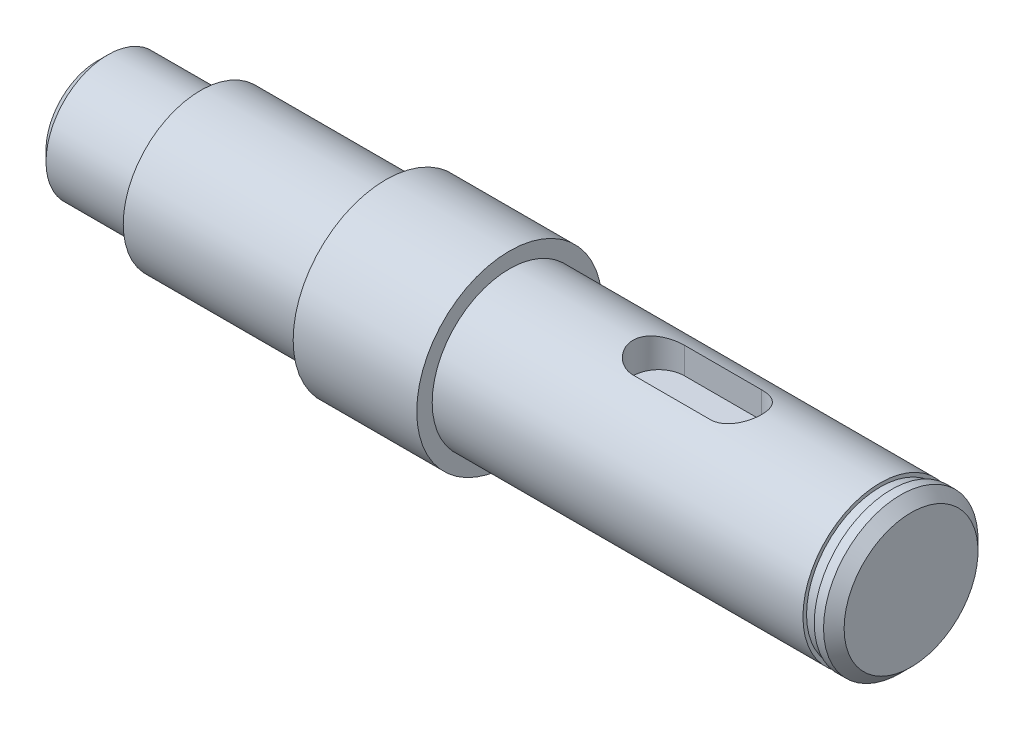
ISO-10303-21;
HEADER;
FILE_DESCRIPTION(('STEP AP214'),'2;1');
FILE_NAME('part.step','',(''),(''),'','','');
FILE_SCHEMA(('AUTOMOTIVE_DESIGN { 1 0 10303 214 1 1 1 1 }'));
ENDSEC;
DATA;
#1=APPLICATION_CONTEXT('core data for automotive mechanical design processes');
#2=APPLICATION_PROTOCOL_DEFINITION('international standard','automotive_design',2000,#1);
#3=PRODUCT_CONTEXT('',#1,'mechanical');
#4=PRODUCT('Part','Part','',(#3));
#5=PRODUCT_RELATED_PRODUCT_CATEGORY('part','',(#4));
#6=PRODUCT_DEFINITION_FORMATION('','',#4);
#7=PRODUCT_DEFINITION_CONTEXT('part definition',#1,'design');
#8=PRODUCT_DEFINITION('design','',#6,#7);
#9=PRODUCT_DEFINITION_SHAPE('','',#8);
#10=(LENGTH_UNIT() NAMED_UNIT(*) SI_UNIT(.MILLI.,.METRE.));
#11=(NAMED_UNIT(*) PLANE_ANGLE_UNIT() SI_UNIT($,.RADIAN.));
#12=(NAMED_UNIT(*) SI_UNIT($,.STERADIAN.) SOLID_ANGLE_UNIT());
#13=UNCERTAINTY_MEASURE_WITH_UNIT(LENGTH_MEASURE(1.E-05),#10,'distance_accuracy_value','');
#14=(GEOMETRIC_REPRESENTATION_CONTEXT(3) GLOBAL_UNCERTAINTY_ASSIGNED_CONTEXT((#13)) GLOBAL_UNIT_ASSIGNED_CONTEXT((#10,
#11,#12)) REPRESENTATION_CONTEXT('',''));
#15=CARTESIAN_POINT('',(0.,0.,0.));
#16=DIRECTION('',(0.,0.,1.));
#17=DIRECTION('',(1.,0.,0.));
#18=AXIS2_PLACEMENT_3D('',#15,#16,#17);
#19=CARTESIAN_POINT('',(0.,0.,0.));
#20=DIRECTION('',(-1.,0.,0.));
#21=DIRECTION('',(0.,0.,1.));
#22=AXIS2_PLACEMENT_3D('',#19,#20,#21);
#23=CYLINDRICAL_SURFACE('',#22,7.5);
#24=DIRECTION('',(-1.,0.,0.));
#25=VECTOR('',#24,1.);
#26=CARTESIAN_POINT('',(0.,7.07106781186548,-2.5));
#27=LINE('',#26,#25);
#28=CARTESIAN_POINT('',(54.5,7.07106781186548,-2.5));
#29=VERTEX_POINT('',#28);
#30=CARTESIAN_POINT('',(62.,7.07106781186548,-2.5));
#31=VERTEX_POINT('',#30);
#32=EDGE_CURVE('E42',#29,#31,#27,.F.);
#33=ORIENTED_EDGE('',*,*,#32,.T.);
#34=CARTESIAN_POINT('',(62.,7.07106781186548,-2.5));
#35=CARTESIAN_POINT('',(62.0682070778203,7.07105693273157,-2.50000899110406));
#36=CARTESIAN_POINT('',(62.1364080746754,7.07205443904569,-2.49720887221585));
#37=CARTESIAN_POINT('',(62.2722810383493,7.07598524121007,-2.4860604578047));
#38=CARTESIAN_POINT('',(62.3399531429881,7.07891801450643,-2.47771365997202));
#39=CARTESIAN_POINT('',(62.4740904883546,7.08662705252507,-2.45557459422795));
#40=CARTESIAN_POINT('',(62.5405587025509,7.09139784850119,-2.44179847763135));
#41=CARTESIAN_POINT('',(62.6720082685828,7.10262619906002,-2.4089418103012));
#42=CARTESIAN_POINT('',(62.7369895665899,7.10908381460331,-2.38986106786032));
#43=CARTESIAN_POINT('',(62.9289615797146,7.13069940793912,-2.32491551306196));
#44=CARTESIAN_POINT('',(63.05317915747,7.14811243884052,-2.27131416810249));
#45=CARTESIAN_POINT('',(63.2908768114634,7.1869703408752,-2.14517784106254));
#46=CARTESIAN_POINT('',(63.4043502357802,7.20841768551076,-2.07263123268531));
#47=CARTESIAN_POINT('',(63.6217929034708,7.25386182389478,-1.90762995846819));
#48=CARTESIAN_POINT('',(63.7252851427682,7.27792189428067,-1.81456284630833));
#49=CARTESIAN_POINT('',(63.9155171032337,7.32534626726038,-1.61247071190512));
#50=CARTESIAN_POINT('',(64.002253841319,7.34871044533518,-1.50344285413657));
#51=CARTESIAN_POINT('',(64.1586982242624,7.39284706096344,-1.26900922493972));
#52=CARTESIAN_POINT('',(64.2279023077422,7.41353593532888,-1.14325025284462));
#53=CARTESIAN_POINT('',(64.3439807824347,7.44924021883279,-0.881073095475297));
#54=CARTESIAN_POINT('',(64.3908619949257,7.46425736081204,-0.744658181225874));
#55=CARTESIAN_POINT('',(64.4593392762582,7.48647677762783,-0.470073371182888));
#56=CARTESIAN_POINT('',(64.4817581709572,7.49393272446142,-0.332129588153729));
#57=CARTESIAN_POINT('',(64.5032907567385,7.50109021034827,-0.0542474216361892));
#58=CARTESIAN_POINT('',(64.5024100009158,7.50079359709905,0.0856904786402286));
#59=CARTESIAN_POINT('',(64.4778892895995,7.49265096581776,0.357759612692416));
#60=CARTESIAN_POINT('',(64.4551434043953,7.48510152476447,0.489981756428183));
#61=CARTESIAN_POINT('',(64.3890170040208,7.46367401253771,0.748610161077321));
#62=CARTESIAN_POINT('',(64.3456353446747,7.44979559044789,0.875016099077747));
#63=CARTESIAN_POINT('',(64.2389465758055,7.41689170677792,1.12038155754036));
#64=CARTESIAN_POINT('',(64.1753848871424,7.39780094595656,1.23922126412504));
#65=CARTESIAN_POINT('',(64.030350121575,7.35645969200236,1.46481147275368));
#66=CARTESIAN_POINT('',(63.9488721723979,7.33420833994017,1.57155867428944));
#67=CARTESIAN_POINT('',(63.765822374993,7.28765679856813,1.77524334927519));
#68=CARTESIAN_POINT('',(63.6634861409717,7.26330946699775,1.871484029031));
#69=CARTESIAN_POINT('',(63.4438962757135,7.21618726182137,2.04568006205174));
#70=CARTESIAN_POINT('',(63.3266378439929,7.19341289789386,2.12362950795974));
#71=CARTESIAN_POINT('',(63.0782995541157,7.15175078440792,2.26000831398175));
#72=CARTESIAN_POINT('',(62.9470412126673,7.13292537370586,2.31813252376915));
#73=CARTESIAN_POINT('',(62.6758825560254,7.10202742655098,2.41115057675285));
#74=CARTESIAN_POINT('',(62.5359962665697,7.08994423522482,2.4460810901384));
#75=CARTESIAN_POINT('',(62.32895340813,7.07841355236799,2.47914539070207));
#76=CARTESIAN_POINT('',(62.2633965253644,7.07566669236505,2.48696265313779));
#77=CARTESIAN_POINT('',(62.1319048040005,7.07199258928497,2.49738654017799));
#78=CARTESIAN_POINT('',(62.065970563639,7.0710629982382,2.49999988848745));
#79=CARTESIAN_POINT('',(62.,7.07106781186548,2.5));
#80=B_SPLINE_CURVE_WITH_KNOTS('',3,(#34,#35,#36,#37,#38,#39,#40,#41,#42,#43,#44,#45,#46,#47,#48,
#49,#50,#51,#52,#53,#54,#55,#56,#57,#58,#59,#60,#61,#62,#63,#64,#65,#66,#67,#68,#69,#70,#71,#72,
#73,#74,#75,#76,#77,#78,#79),.UNSPECIFIED.,.F.,.F.,(4,2,2,2,2,2,2,2,2,2,2,2,2,2,2,2,2,2,2,2,2,2,
4),(0.,0.20454621183858,0.409037215423656,0.612924429429085,0.816819012805401,1.22401016923257,
1.63145179965526,2.0532786408839,2.47518051341062,2.90809434014447,3.34087579484514,
3.75860278500203,4.17623021758302,4.57747647846034,4.97874498952316,5.38529148746615,
5.79194868153617,6.21771736826823,6.64362337304805,7.07581676501794,7.5073252039879,
7.70536340013571,7.90314555504336),.UNSPECIFIED.);
#81=CARTESIAN_POINT('',(62.,7.07106781186548,2.5));
#82=VERTEX_POINT('',#81);
#83=EDGE_CURVE('E142',#31,#82,#80,.T.);
#84=ORIENTED_EDGE('',*,*,#83,.T.);
#85=DIRECTION('',(-1.,0.,0.));
#86=VECTOR('',#85,1.);
#87=CARTESIAN_POINT('',(0.,7.07106781186548,2.5));
#88=LINE('',#87,#86);
#89=CARTESIAN_POINT('',(54.5,7.07106781186548,2.5));
#90=VERTEX_POINT('',#89);
#91=EDGE_CURVE('E291',#82,#90,#88,.T.);
#92=ORIENTED_EDGE('',*,*,#91,.T.);
#93=CARTESIAN_POINT('',(54.5,7.07106781186548,2.5));
#94=CARTESIAN_POINT('',(54.4317929221797,7.07105693273157,2.50000899110406));
#95=CARTESIAN_POINT('',(54.3635919253246,7.07205443904569,2.49720887221585));
#96=CARTESIAN_POINT('',(54.2277189616507,7.07598524121007,2.4860604578047));
#97=CARTESIAN_POINT('',(54.1600468570119,7.07891801450642,2.47771365997202));
#98=CARTESIAN_POINT('',(54.0259095116455,7.08662705252507,2.45557459422795));
#99=CARTESIAN_POINT('',(53.9594412974491,7.09139784850119,2.44179847763135));
#100=CARTESIAN_POINT('',(53.8279917314172,7.10262619906002,2.4089418103012));
#101=CARTESIAN_POINT('',(53.7630104334101,7.10908381460331,2.38986106786032));
#102=CARTESIAN_POINT('',(53.5710384202854,7.13069940793911,2.32491551306196));
#103=CARTESIAN_POINT('',(53.44682084253,7.14811243884052,2.27131416810249));
#104=CARTESIAN_POINT('',(53.2091231885366,7.1869703408752,2.14517784106254));
#105=CARTESIAN_POINT('',(53.0956497642198,7.20841768551076,2.07263123268532));
#106=CARTESIAN_POINT('',(52.8782070965292,7.25386182389478,1.90762995846819));
#107=CARTESIAN_POINT('',(52.7747148572318,7.27792189428067,1.81456284630833));
#108=CARTESIAN_POINT('',(52.5844828967663,7.32534626726038,1.61247071190512));
#109=CARTESIAN_POINT('',(52.497746158681,7.34871044533518,1.50344285413657));
#110=CARTESIAN_POINT('',(52.3413017757376,7.39284706096344,1.26900922493972));
#111=CARTESIAN_POINT('',(52.2720976922578,7.41353593532888,1.14325025284462));
#112=CARTESIAN_POINT('',(52.1560192175653,7.44924021883279,0.881073095475297));
#113=CARTESIAN_POINT('',(52.1091380050743,7.46425736081204,0.744658181225882));
#114=CARTESIAN_POINT('',(52.0406607237418,7.48647677762783,0.470073371182902));
#115=CARTESIAN_POINT('',(52.0182418290428,7.49393272446142,0.332129588153741));
#116=CARTESIAN_POINT('',(51.9967092432615,7.50109021034827,0.0542474216362003));
#117=CARTESIAN_POINT('',(51.9975899990842,7.50079359709905,-0.0856904786402171));
#118=CARTESIAN_POINT('',(52.0221107104005,7.49265096581776,-0.357759612692405));
#119=CARTESIAN_POINT('',(52.0448565956047,7.48510152476446,-0.489981756428173));
#120=CARTESIAN_POINT('',(52.1109829959792,7.46367401253772,-0.748610161077311));
#121=CARTESIAN_POINT('',(52.1543646553253,7.4497955904479,-0.875016099077736));
#122=CARTESIAN_POINT('',(52.2610534241945,7.41689170677793,-1.12038155754035));
#123=CARTESIAN_POINT('',(52.3246151128576,7.39780094595656,-1.23922126412504));
#124=CARTESIAN_POINT('',(52.469649878425,7.35645969200235,-1.46481147275367));
#125=CARTESIAN_POINT('',(52.5511278276021,7.33420833994017,-1.57155867428943));
#126=CARTESIAN_POINT('',(52.734177625007,7.28765679856813,-1.77524334927518));
#127=CARTESIAN_POINT('',(52.8365138590283,7.26330946699775,-1.871484029031));
#128=CARTESIAN_POINT('',(53.0561037242865,7.21618726182137,-2.04568006205174));
#129=CARTESIAN_POINT('',(53.1733621560071,7.19341289789386,-2.12362950795974));
#130=CARTESIAN_POINT('',(53.4217004458843,7.15175078440792,-2.26000831398174));
#131=CARTESIAN_POINT('',(53.5529587873327,7.13292537370586,-2.31813252376915));
#132=CARTESIAN_POINT('',(53.8241174439746,7.10202742655098,-2.41115057675285));
#133=CARTESIAN_POINT('',(53.9640037334303,7.08994423522482,-2.4460810901384));
#134=CARTESIAN_POINT('',(54.17104659187,7.07841355236799,-2.47914539070207));
#135=CARTESIAN_POINT('',(54.2366034746356,7.07566669236504,-2.48696265313779));
#136=CARTESIAN_POINT('',(54.3680951959995,7.07199258928497,-2.49738654017799));
#137=CARTESIAN_POINT('',(54.434029436361,7.0710629982382,-2.49999988848745));
#138=CARTESIAN_POINT('',(54.5,7.07106781186548,-2.5));
#139=B_SPLINE_CURVE_WITH_KNOTS('',3,(#93,#94,#95,#96,#97,#98,#99,#100,#101,#102,#103,#104,#105,
#106,#107,#108,#109,#110,#111,#112,#113,#114,#115,#116,#117,#118,#119,#120,#121,#122,#123,#124,
#125,#126,#127,#128,#129,#130,#131,#132,#133,#134,#135,#136,#137,#138),.UNSPECIFIED.,.F.,.F.,(4,
2,2,2,2,2,2,2,2,2,2,2,2,2,2,2,2,2,2,2,2,2,4),(0.,0.204546211838573,0.409037215423656,
0.612924429429078,0.816819012805401,1.22401016923257,1.63145179965526,2.0532786408839,
2.47518051341062,2.90809434014448,3.34087579484513,3.75860278500202,4.17623021758301,
4.57747647846033,4.97874498952315,5.38529148746615,5.79194868153617,6.21771736826823,
6.64362337304804,7.07581676501795,7.50732520398791,7.70536340013572,7.90314555504336),.UNSPECIFIED.);
#140=EDGE_CURVE('E34',#90,#29,#139,.T.);
#141=ORIENTED_EDGE('',*,*,#140,.T.);
#142=EDGE_LOOP('',(#33,#84,#92,#141));
#143=FACE_BOUND('',#142,.T.);
#144=CARTESIAN_POINT('',(40.,0.,0.));
#145=DIRECTION('',(-1.,0.,0.));
#146=DIRECTION('',(0.,0.,1.));
#147=AXIS2_PLACEMENT_3D('',#144,#145,#146);
#148=CIRCLE('',#147,7.5);
#149=CARTESIAN_POINT('',(40.,0.,7.5));
#150=VERTEX_POINT('',#149);
#151=EDGE_CURVE('E122',#150,#150,#148,.T.);
#152=ORIENTED_EDGE('',*,*,#151,.F.);
#153=EDGE_LOOP('',(#152));
#154=FACE_BOUND('',#153,.T.);
#155=CARTESIAN_POINT('',(76.,0.,0.));
#156=DIRECTION('',(1.,0.,0.));
#157=DIRECTION('',(0.,0.,-1.));
#158=AXIS2_PLACEMENT_3D('',#155,#156,#157);
#159=CIRCLE('',#158,7.5);
#160=CARTESIAN_POINT('',(76.,0.,-7.5));
#161=VERTEX_POINT('',#160);
#162=EDGE_CURVE('E95',#161,#161,#159,.T.);
#163=ORIENTED_EDGE('',*,*,#162,.F.);
#164=EDGE_LOOP('',(#163));
#165=FACE_BOUND('',#164,.T.);
#166=ADVANCED_FACE('F17',(#143,#154,#165),#23,.T.);
#167=CARTESIAN_POINT('',(40.,9.,0.));
#168=DIRECTION('',(-1.,0.,0.));
#169=DIRECTION('',(0.,0.,1.));
#170=AXIS2_PLACEMENT_3D('',#167,#168,#169);
#171=PLANE('',#170);
#172=CARTESIAN_POINT('',(40.,0.,0.));
#173=DIRECTION('',(-1.,0.,0.));
#174=DIRECTION('',(0.,0.,1.));
#175=AXIS2_PLACEMENT_3D('',#172,#173,#174);
#176=CIRCLE('',#175,9.);
#177=CARTESIAN_POINT('',(40.,0.,9.));
#178=VERTEX_POINT('',#177);
#179=EDGE_CURVE('E118',#178,#178,#176,.T.);
#180=ORIENTED_EDGE('',*,*,#179,.F.);
#181=EDGE_LOOP('',(#180));
#182=FACE_BOUND('',#181,.T.);
#183=ORIENTED_EDGE('',*,*,#151,.T.);
#184=EDGE_LOOP('',(#183));
#185=FACE_BOUND('',#184,.T.);
#186=ADVANCED_FACE('F251',(#182,#185),#171,.F.);
#187=CARTESIAN_POINT('',(0.,0.,0.));
#188=DIRECTION('',(-1.,0.,0.));
#189=DIRECTION('',(0.,0.,1.));
#190=AXIS2_PLACEMENT_3D('',#187,#188,#189);
#191=CYLINDRICAL_SURFACE('',#190,9.);
#192=CARTESIAN_POINT('',(28.,0.,0.));
#193=DIRECTION('',(-1.,0.,0.));
#194=DIRECTION('',(0.,0.,1.));
#195=AXIS2_PLACEMENT_3D('',#192,#193,#194);
#196=CIRCLE('',#195,9.);
#197=CARTESIAN_POINT('',(28.,0.,9.));
#198=VERTEX_POINT('',#197);
#199=EDGE_CURVE('E114',#198,#198,#196,.T.);
#200=ORIENTED_EDGE('',*,*,#199,.F.);
#201=EDGE_LOOP('',(#200));
#202=FACE_BOUND('',#201,.T.);
#203=ORIENTED_EDGE('',*,*,#179,.T.);
#204=EDGE_LOOP('',(#203));
#205=FACE_BOUND('',#204,.T.);
#206=ADVANCED_FACE('F248',(#202,#205),#191,.T.);
#207=CARTESIAN_POINT('',(28.,7.5,0.));
#208=DIRECTION('',(1.,0.,0.));
#209=DIRECTION('',(0.,0.,-1.));
#210=AXIS2_PLACEMENT_3D('',#207,#208,#209);
#211=PLANE('',#210);
#212=CARTESIAN_POINT('',(28.,0.,0.));
#213=DIRECTION('',(-1.,0.,0.));
#214=DIRECTION('',(0.,0.,1.));
#215=AXIS2_PLACEMENT_3D('',#212,#213,#214);
#216=CIRCLE('',#215,7.5);
#217=CARTESIAN_POINT('',(28.,0.,7.5));
#218=VERTEX_POINT('',#217);
#219=EDGE_CURVE('E110',#218,#218,#216,.T.);
#220=ORIENTED_EDGE('',*,*,#219,.F.);
#221=EDGE_LOOP('',(#220));
#222=FACE_BOUND('',#221,.T.);
#223=ORIENTED_EDGE('',*,*,#199,.T.);
#224=EDGE_LOOP('',(#223));
#225=FACE_BOUND('',#224,.T.);
#226=ADVANCED_FACE('F244',(#222,#225),#211,.F.);
#227=CARTESIAN_POINT('',(0.,0.,0.));
#228=DIRECTION('',(-1.,0.,0.));
#229=DIRECTION('',(0.,0.,1.));
#230=AXIS2_PLACEMENT_3D('',#227,#228,#229);
#231=CYLINDRICAL_SURFACE('',#230,7.5);
#232=CARTESIAN_POINT('',(10.,0.,0.));
#233=DIRECTION('',(-1.,0.,0.));
#234=DIRECTION('',(0.,0.,1.));
#235=AXIS2_PLACEMENT_3D('',#232,#233,#234);
#236=CIRCLE('',#235,7.5);
#237=CARTESIAN_POINT('',(10.,0.,7.5));
#238=VERTEX_POINT('',#237);
#239=EDGE_CURVE('E105',#238,#238,#236,.T.);
#240=ORIENTED_EDGE('',*,*,#239,.F.);
#241=EDGE_LOOP('',(#240));
#242=FACE_BOUND('',#241,.T.);
#243=ORIENTED_EDGE('',*,*,#219,.T.);
#244=EDGE_LOOP('',(#243));
#245=FACE_BOUND('',#244,.T.);
#246=ADVANCED_FACE('F240',(#242,#245),#231,.T.);
#247=CARTESIAN_POINT('',(10.,6.,0.));
#248=DIRECTION('',(1.,0.,0.));
#249=DIRECTION('',(0.,0.,-1.));
#250=AXIS2_PLACEMENT_3D('',#247,#248,#249);
#251=PLANE('',#250);
#252=CARTESIAN_POINT('',(10.,0.,0.));
#253=DIRECTION('',(-1.,0.,0.));
#254=DIRECTION('',(0.,0.,1.));
#255=AXIS2_PLACEMENT_3D('',#252,#253,#254);
#256=CIRCLE('',#255,6.);
#257=CARTESIAN_POINT('',(10.,0.,6.));
#258=VERTEX_POINT('',#257);
#259=EDGE_CURVE('E101',#258,#258,#256,.T.);
#260=ORIENTED_EDGE('',*,*,#259,.F.);
#261=EDGE_LOOP('',(#260));
#262=FACE_BOUND('',#261,.T.);
#263=ORIENTED_EDGE('',*,*,#239,.T.);
#264=EDGE_LOOP('',(#263));
#265=FACE_BOUND('',#264,.T.);
#266=ADVANCED_FACE('F236',(#262,#265),#251,.F.);
#267=CARTESIAN_POINT('',(0.,0.,0.));
#268=DIRECTION('',(-1.,0.,0.));
#269=DIRECTION('',(0.,0.,1.));
#270=AXIS2_PLACEMENT_3D('',#267,#268,#269);
#271=CYLINDRICAL_SURFACE('',#270,6.);
#272=CARTESIAN_POINT('',(1.,0.,0.));
#273=DIRECTION('',(1.,0.,0.));
#274=DIRECTION('',(0.,0.,-1.));
#275=AXIS2_PLACEMENT_3D('',#272,#273,#274);
#276=CIRCLE('',#275,6.);
#277=CARTESIAN_POINT('',(1.,0.,-6.));
#278=VERTEX_POINT('',#277);
#279=EDGE_CURVE('E138',#278,#278,#276,.T.);
#280=ORIENTED_EDGE('',*,*,#279,.T.);
#281=EDGE_LOOP('',(#280));
#282=FACE_BOUND('',#281,.T.);
#283=ORIENTED_EDGE('',*,*,#259,.T.);
#284=EDGE_LOOP('',(#283));
#285=FACE_BOUND('',#284,.T.);
#286=ADVANCED_FACE('F232',(#282,#285),#271,.T.);
#287=CARTESIAN_POINT('',(0.,0.,0.));
#288=DIRECTION('',(1.,0.,0.));
#289=DIRECTION('',(0.,0.,-1.));
#290=AXIS2_PLACEMENT_3D('',#287,#288,#289);
#291=PLANE('',#290);
#292=CARTESIAN_POINT('',(0.,0.,0.));
#293=DIRECTION('',(1.,0.,0.));
#294=DIRECTION('',(0.,0.,-1.));
#295=AXIS2_PLACEMENT_3D('',#292,#293,#294);
#296=CIRCLE('',#295,5.);
#297=CARTESIAN_POINT('',(0.,0.,-5.));
#298=VERTEX_POINT('',#297);
#299=EDGE_CURVE('E134',#298,#298,#296,.F.);
#300=ORIENTED_EDGE('',*,*,#299,.T.);
#301=EDGE_LOOP('',(#300));
#302=FACE_BOUND('',#301,.T.);
#303=ADVANCED_FACE('F229',(#302),#291,.F.);
#304=CARTESIAN_POINT('',(0.,0.,0.));
#305=DIRECTION('',(1.,0.,0.));
#306=DIRECTION('',(0.,0.,-1.));
#307=AXIS2_PLACEMENT_3D('',#304,#305,#306);
#308=CONICAL_SURFACE('',#307,5.,0.785398163397445);
#309=ORIENTED_EDGE('',*,*,#279,.F.);
#310=EDGE_LOOP('',(#309));
#311=FACE_BOUND('',#310,.T.);
#312=ORIENTED_EDGE('',*,*,#299,.F.);
#313=EDGE_LOOP('',(#312));
#314=FACE_BOUND('',#313,.T.);
#315=ADVANCED_FACE('F19',(#311,#314),#308,.T.);
#316=CARTESIAN_POINT('',(77.1,0.,7.26));
#317=DIRECTION('',(-1.,0.,0.));
#318=DIRECTION('',(0.,0.,1.));
#319=AXIS2_PLACEMENT_3D('',#316,#317,#318);
#320=PLANE('',#319);
#321=CARTESIAN_POINT('',(77.1,0.,0.));
#322=DIRECTION('',(-1.,0.,0.));
#323=DIRECTION('',(0.,0.,1.));
#324=AXIS2_PLACEMENT_3D('',#321,#322,#323);
#325=CIRCLE('',#324,7.5);
#326=CARTESIAN_POINT('',(77.1,0.,7.5));
#327=VERTEX_POINT('',#326);
#328=EDGE_CURVE('E106',#327,#327,#325,.T.);
#329=ORIENTED_EDGE('',*,*,#328,.T.);
#330=EDGE_LOOP('',(#329));
#331=FACE_BOUND('',#330,.T.);
#332=CARTESIAN_POINT('',(77.1,0.,0.));
#333=DIRECTION('',(-1.,0.,0.));
#334=DIRECTION('',(0.,0.,1.));
#335=AXIS2_PLACEMENT_3D('',#332,#333,#334);
#336=CIRCLE('',#335,7.15);
#337=CARTESIAN_POINT('',(77.1,0.,7.15));
#338=VERTEX_POINT('',#337);
#339=EDGE_CURVE('E27',#338,#338,#336,.F.);
#340=ORIENTED_EDGE('',*,*,#339,.T.);
#341=EDGE_LOOP('',(#340));
#342=FACE_BOUND('',#341,.T.);
#343=ADVANCED_FACE('F220',(#331,#342),#320,.T.);
#344=CARTESIAN_POINT('',(76.,0.,9.));
#345=DIRECTION('',(1.,0.,0.));
#346=DIRECTION('',(0.,0.,-1.));
#347=AXIS2_PLACEMENT_3D('',#344,#345,#346);
#348=PLANE('',#347);
#349=ORIENTED_EDGE('',*,*,#162,.T.);
#350=EDGE_LOOP('',(#349));
#351=FACE_BOUND('',#350,.T.);
#352=CARTESIAN_POINT('',(76.,0.,0.));
#353=DIRECTION('',(1.,0.,0.));
#354=DIRECTION('',(0.,0.,-1.));
#355=AXIS2_PLACEMENT_3D('',#352,#353,#354);
#356=CIRCLE('',#355,7.15);
#357=CARTESIAN_POINT('',(76.,0.,-7.15));
#358=VERTEX_POINT('',#357);
#359=EDGE_CURVE('E11',#358,#358,#356,.T.);
#360=ORIENTED_EDGE('',*,*,#359,.F.);
#361=EDGE_LOOP('',(#360));
#362=FACE_BOUND('',#361,.T.);
#363=ADVANCED_FACE('F216',(#351,#362),#348,.T.);
#364=CARTESIAN_POINT('',(79.,0.,0.));
#365=DIRECTION('',(-1.,0.,0.));
#366=DIRECTION('',(0.,0.,1.));
#367=AXIS2_PLACEMENT_3D('',#364,#365,#366);
#368=CYLINDRICAL_SURFACE('',#367,7.15);
#369=ORIENTED_EDGE('',*,*,#339,.F.);
#370=EDGE_LOOP('',(#369));
#371=FACE_BOUND('',#370,.T.);
#372=ORIENTED_EDGE('',*,*,#359,.T.);
#373=EDGE_LOOP('',(#372));
#374=FACE_BOUND('',#373,.T.);
#375=ADVANCED_FACE('F219',(#371,#374),#368,.T.);
#376=CARTESIAN_POINT('',(79.,0.,0.));
#377=DIRECTION('',(-1.,0.,0.));
#378=DIRECTION('',(0.,0.,1.));
#379=AXIS2_PLACEMENT_3D('',#376,#377,#378);
#380=PLANE('',#379);
#381=CARTESIAN_POINT('',(79.,0.,0.));
#382=DIRECTION('',(-1.,0.,0.));
#383=DIRECTION('',(0.,0.,1.));
#384=AXIS2_PLACEMENT_3D('',#381,#382,#383);
#385=CIRCLE('',#384,6.5);
#386=CARTESIAN_POINT('',(79.,0.,6.5));
#387=VERTEX_POINT('',#386);
#388=EDGE_CURVE('E130',#387,#387,#385,.F.);
#389=ORIENTED_EDGE('',*,*,#388,.T.);
#390=EDGE_LOOP('',(#389));
#391=FACE_BOUND('',#390,.T.);
#392=ADVANCED_FACE('F224',(#391),#380,.F.);
#393=CARTESIAN_POINT('',(78.,0.,0.));
#394=DIRECTION('',(-1.,0.,0.));
#395=DIRECTION('',(0.,0.,1.));
#396=AXIS2_PLACEMENT_3D('',#393,#394,#395);
#397=CONICAL_SURFACE('',#396,7.5,0.785398163397452);
#398=ORIENTED_EDGE('',*,*,#388,.F.);
#399=EDGE_LOOP('',(#398));
#400=FACE_BOUND('',#399,.T.);
#401=CARTESIAN_POINT('',(78.,0.,0.));
#402=DIRECTION('',(-1.,0.,0.));
#403=DIRECTION('',(0.,0.,1.));
#404=AXIS2_PLACEMENT_3D('',#401,#402,#403);
#405=CIRCLE('',#404,7.5);
#406=CARTESIAN_POINT('',(78.,0.,7.5));
#407=VERTEX_POINT('',#406);
#408=EDGE_CURVE('E126',#407,#407,#405,.T.);
#409=ORIENTED_EDGE('',*,*,#408,.F.);
#410=EDGE_LOOP('',(#409));
#411=FACE_BOUND('',#410,.T.);
#412=ADVANCED_FACE('F275',(#400,#411),#397,.T.);
#413=ORIENTED_EDGE('',*,*,#408,.T.);
#414=EDGE_LOOP('',(#413));
#415=FACE_BOUND('',#414,.T.);
#416=ORIENTED_EDGE('',*,*,#328,.F.);
#417=EDGE_LOOP('',(#416));
#418=FACE_BOUND('',#417,.T.);
#419=ADVANCED_FACE('F200',(#415,#418),#23,.T.);
#420=CARTESIAN_POINT('',(54.5,4.5,0.));
#421=DIRECTION('',(0.,1.,0.));
#422=DIRECTION('',(0.,0.,1.));
#423=AXIS2_PLACEMENT_3D('',#420,#421,#422);
#424=CYLINDRICAL_SURFACE('',#423,2.5);
#425=DIRECTION('',(0.,1.,0.));
#426=VECTOR('',#425,1.);
#427=CARTESIAN_POINT('',(54.5,4.5,2.5));
#428=LINE('',#427,#426);
#429=CARTESIAN_POINT('',(54.5,4.5,2.5));
#430=VERTEX_POINT('',#429);
#431=EDGE_CURVE('E59',#430,#90,#428,.T.);
#432=ORIENTED_EDGE('',*,*,#431,.F.);
#433=CARTESIAN_POINT('',(54.5,4.5,0.));
#434=DIRECTION('',(0.,1.,0.));
#435=DIRECTION('',(0.,0.,1.));
#436=AXIS2_PLACEMENT_3D('',#433,#434,#435);
#437=CIRCLE('',#436,2.5);
#438=CARTESIAN_POINT('',(54.5,4.5,-2.5));
#439=VERTEX_POINT('',#438);
#440=EDGE_CURVE('E63',#439,#430,#437,.T.);
#441=ORIENTED_EDGE('',*,*,#440,.F.);
#442=DIRECTION('',(0.,1.,0.));
#443=VECTOR('',#442,1.);
#444=CARTESIAN_POINT('',(54.5,4.5,-2.5));
#445=LINE('',#444,#443);
#446=EDGE_CURVE('E92',#439,#29,#445,.T.);
#447=ORIENTED_EDGE('',*,*,#446,.T.);
#448=ORIENTED_EDGE('',*,*,#140,.F.);
#449=EDGE_LOOP('',(#432,#441,#447,#448));
#450=FACE_BOUND('',#449,.T.);
#451=ADVANCED_FACE('F61',(#450),#424,.F.);
#452=CARTESIAN_POINT('',(54.5,4.5,-2.5));
#453=DIRECTION('',(0.,0.,-1.));
#454=DIRECTION('',(-1.,0.,0.));
#455=AXIS2_PLACEMENT_3D('',#452,#453,#454);
#456=PLANE('',#455);
#457=ORIENTED_EDGE('',*,*,#446,.F.);
#458=DIRECTION('',(-1.,0.,0.));
#459=VECTOR('',#458,1.);
#460=CARTESIAN_POINT('',(54.5,4.5,-2.5));
#461=LINE('',#460,#459);
#462=CARTESIAN_POINT('',(62.,4.5,-2.5));
#463=VERTEX_POINT('',#462);
#464=EDGE_CURVE('E69',#463,#439,#461,.T.);
#465=ORIENTED_EDGE('',*,*,#464,.F.);
#466=DIRECTION('',(0.,1.,0.));
#467=VECTOR('',#466,1.);
#468=CARTESIAN_POINT('',(62.,4.5,-2.5));
#469=LINE('',#468,#467);
#470=EDGE_CURVE('E96',#463,#31,#469,.T.);
#471=ORIENTED_EDGE('',*,*,#470,.T.);
#472=ORIENTED_EDGE('',*,*,#32,.F.);
#473=EDGE_LOOP('',(#457,#465,#471,#472));
#474=FACE_BOUND('',#473,.T.);
#475=ADVANCED_FACE('F209',(#474),#456,.F.);
#476=CARTESIAN_POINT('',(62.,4.5,0.));
#477=DIRECTION('',(0.,1.,0.));
#478=DIRECTION('',(0.,0.,1.));
#479=AXIS2_PLACEMENT_3D('',#476,#477,#478);
#480=CYLINDRICAL_SURFACE('',#479,2.5);
#481=ORIENTED_EDGE('',*,*,#470,.F.);
#482=CARTESIAN_POINT('',(62.,4.5,0.));
#483=DIRECTION('',(0.,1.,0.));
#484=DIRECTION('',(0.,0.,1.));
#485=AXIS2_PLACEMENT_3D('',#482,#483,#484);
#486=CIRCLE('',#485,2.5);
#487=CARTESIAN_POINT('',(62.,4.5,2.5));
#488=VERTEX_POINT('',#487);
#489=EDGE_CURVE('E79',#488,#463,#486,.T.);
#490=ORIENTED_EDGE('',*,*,#489,.F.);
#491=DIRECTION('',(0.,1.,0.));
#492=VECTOR('',#491,1.);
#493=CARTESIAN_POINT('',(62.,4.5,2.5));
#494=LINE('',#493,#492);
#495=EDGE_CURVE('E68',#488,#82,#494,.T.);
#496=ORIENTED_EDGE('',*,*,#495,.T.);
#497=ORIENTED_EDGE('',*,*,#83,.F.);
#498=EDGE_LOOP('',(#481,#490,#496,#497));
#499=FACE_BOUND('',#498,.T.);
#500=ADVANCED_FACE('F204',(#499),#480,.F.);
#501=CARTESIAN_POINT('',(54.5,4.5,2.5));
#502=DIRECTION('',(0.,0.,1.));
#503=DIRECTION('',(1.,0.,0.));
#504=AXIS2_PLACEMENT_3D('',#501,#502,#503);
#505=PLANE('',#504);
#506=ORIENTED_EDGE('',*,*,#495,.F.);
#507=DIRECTION('',(1.,0.,0.));
#508=VECTOR('',#507,1.);
#509=CARTESIAN_POINT('',(54.5,4.5,2.5));
#510=LINE('',#509,#508);
#511=EDGE_CURVE('E72',#430,#488,#510,.T.);
#512=ORIENTED_EDGE('',*,*,#511,.F.);
#513=ORIENTED_EDGE('',*,*,#431,.T.);
#514=ORIENTED_EDGE('',*,*,#91,.F.);
#515=EDGE_LOOP('',(#506,#512,#513,#514));
#516=FACE_BOUND('',#515,.T.);
#517=ADVANCED_FACE('F73',(#516),#505,.F.);
#518=CARTESIAN_POINT('',(54.5,4.5,0.));
#519=DIRECTION('',(0.,1.,0.));
#520=DIRECTION('',(0.,0.,1.));
#521=AXIS2_PLACEMENT_3D('',#518,#519,#520);
#522=PLANE('',#521);
#523=ORIENTED_EDGE('',*,*,#440,.T.);
#524=ORIENTED_EDGE('',*,*,#511,.T.);
#525=ORIENTED_EDGE('',*,*,#489,.T.);
#526=ORIENTED_EDGE('',*,*,#464,.T.);
#527=EDGE_LOOP('',(#523,#524,#525,#526));
#528=FACE_BOUND('',#527,.T.);
#529=ADVANCED_FACE('F81',(#528),#522,.T.);
#530=CLOSED_SHELL('',(#166,#186,#206,#226,#246,#266,#286,#303,#315,#343,#363,#375,#392,#412,
#419,#451,#475,#500,#517,#529));
#531=MANIFOLD_SOLID_BREP('B1',#530);
#532=ADVANCED_BREP_SHAPE_REPRESENTATION('',(#18,#531),#14);
#533=SHAPE_DEFINITION_REPRESENTATION(#9,#532);
ENDSEC;
END-ISO-10303-21;
